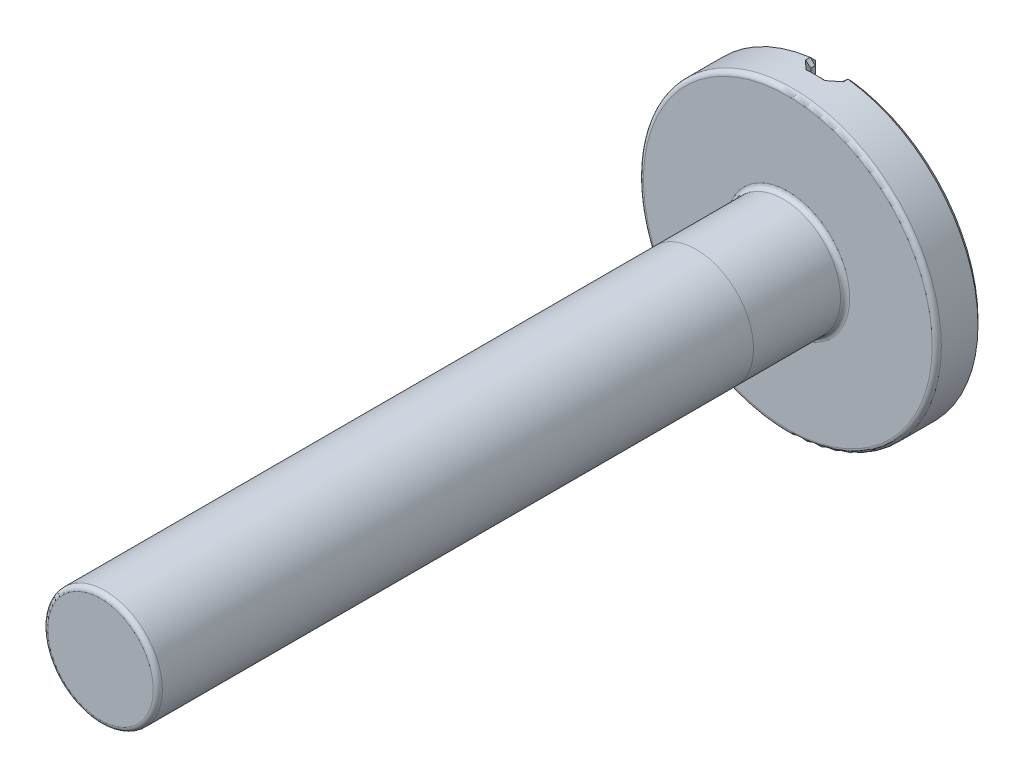
ISO-10303-21;
HEADER;
FILE_DESCRIPTION(('STEP AP214'),'2;1');
FILE_NAME('part.step','',(''),(''),'','','');
FILE_SCHEMA(('AUTOMOTIVE_DESIGN { 1 0 10303 214 1 1 1 1 }'));
ENDSEC;
DATA;
#1=APPLICATION_CONTEXT('core data for automotive mechanical design processes');
#2=APPLICATION_PROTOCOL_DEFINITION('international standard','automotive_design',2000,#1);
#3=PRODUCT_CONTEXT('',#1,'mechanical');
#4=PRODUCT('Part','Part','',(#3));
#5=PRODUCT_RELATED_PRODUCT_CATEGORY('part','',(#4));
#6=PRODUCT_DEFINITION_FORMATION('','',#4);
#7=PRODUCT_DEFINITION_CONTEXT('part definition',#1,'design');
#8=PRODUCT_DEFINITION('design','',#6,#7);
#9=PRODUCT_DEFINITION_SHAPE('','',#8);
#10=(LENGTH_UNIT() NAMED_UNIT(*) SI_UNIT(.MILLI.,.METRE.));
#11=(NAMED_UNIT(*) PLANE_ANGLE_UNIT() SI_UNIT($,.RADIAN.));
#12=(NAMED_UNIT(*) SI_UNIT($,.STERADIAN.) SOLID_ANGLE_UNIT());
#13=UNCERTAINTY_MEASURE_WITH_UNIT(LENGTH_MEASURE(1.E-05),#10,'distance_accuracy_value','');
#14=(GEOMETRIC_REPRESENTATION_CONTEXT(3) GLOBAL_UNCERTAINTY_ASSIGNED_CONTEXT((#13)) GLOBAL_UNIT_ASSIGNED_CONTEXT((#10,
#11,#12)) REPRESENTATION_CONTEXT('',''));
#15=CARTESIAN_POINT('',(0.,0.,0.));
#16=DIRECTION('',(0.,0.,1.));
#17=DIRECTION('',(1.,0.,0.));
#18=AXIS2_PLACEMENT_3D('',#15,#16,#17);
#19=CARTESIAN_POINT('',(0.,0.,7.5));
#20=DIRECTION('',(0.,0.,-1.));
#21=DIRECTION('',(-1.,0.,0.));
#22=AXIS2_PLACEMENT_3D('',#19,#20,#21);
#23=CYLINDRICAL_SURFACE('',#22,0.625);
#24=CARTESIAN_POINT('',(0.,0.,7.45));
#25=DIRECTION('',(0.,0.,1.));
#26=DIRECTION('',(1.,0.,0.));
#27=AXIS2_PLACEMENT_3D('',#24,#25,#26);
#28=CIRCLE('',#27,0.625);
#29=CARTESIAN_POINT('',(0.625,0.,7.45));
#30=VERTEX_POINT('',#29);
#31=EDGE_CURVE('E55',#30,#30,#28,.F.);
#32=ORIENTED_EDGE('',*,*,#31,.T.);
#33=EDGE_LOOP('',(#32));
#34=FACE_BOUND('',#33,.T.);
#35=CARTESIAN_POINT('',(0.,0.,0.999999999999999));
#36=DIRECTION('',(0.,0.,-1.));
#37=DIRECTION('',(0.,1.,0.));
#38=AXIS2_PLACEMENT_3D('',#35,#36,#37);
#39=CIRCLE('',#38,0.625);
#40=CARTESIAN_POINT('',(0.,0.625,0.999999999999999));
#41=VERTEX_POINT('',#40);
#42=EDGE_CURVE('E11',#41,#41,#39,.T.);
#43=ORIENTED_EDGE('',*,*,#42,.F.);
#44=EDGE_LOOP('',(#43));
#45=FACE_BOUND('',#44,.T.);
#46=ADVANCED_FACE('F46',(#34,#45),#23,.T.);
#47=CARTESIAN_POINT('',(0.,0.,-0.5));
#48=DIRECTION('',(0.,0.,1.));
#49=DIRECTION('',(1.,0.,0.));
#50=AXIS2_PLACEMENT_3D('',#47,#48,#49);
#51=CYLINDRICAL_SURFACE('',#50,1.625);
#52=CARTESIAN_POINT('',(0.,0.,-0.05));
#53=DIRECTION('',(0.,0.,1.));
#54=DIRECTION('',(1.,0.,0.));
#55=AXIS2_PLACEMENT_3D('',#52,#53,#54);
#56=CIRCLE('',#55,1.625);
#57=CARTESIAN_POINT('',(1.625,0.,-0.05));
#58=VERTEX_POINT('',#57);
#59=EDGE_CURVE('E514',#58,#58,#56,.F.);
#60=ORIENTED_EDGE('',*,*,#59,.T.);
#61=EDGE_LOOP('',(#60));
#62=FACE_BOUND('',#61,.T.);
#63=CARTESIAN_POINT('',(-0.206349206349206,1.61184521745702,-0.4));
#64=CARTESIAN_POINT('',(-0.197543907697521,1.61297235440929,-0.391183519980273));
#65=CARTESIAN_POINT('',(-0.188700261921241,1.61403127830941,-0.382396487362012));
#66=CARTESIAN_POINT('',(-0.170932435792585,1.61600963826394,-0.364888381673339));
#67=CARTESIAN_POINT('',(-0.162008255301008,1.6169290740772,-0.356167308716982));
#68=CARTESIAN_POINT('',(-0.136565822521117,1.61933576390132,-0.331524516627655));
#69=CARTESIAN_POINT('',(-0.119947344819389,1.62065362350429,-0.315689607558255));
#70=CARTESIAN_POINT('',(-0.103174603188669,1.62172130814234,-0.300000000008677));
#71=B_SPLINE_CURVE_WITH_KNOTS('',3,(#63,#64,#65,#66,#67,#68,#69,#70),.UNSPECIFIED.,.F.,.F.,(4,2,
2,4),(0.,0.0375339196909394,0.0750679042698759,0.144038304244722),.UNSPECIFIED.);
#72=CARTESIAN_POINT('',(-0.206349206349206,1.61184521745702,-0.4));
#73=VERTEX_POINT('',#72);
#74=CARTESIAN_POINT('',(-0.103174603174603,1.62172130813521,-0.3));
#75=VERTEX_POINT('',#74);
#76=EDGE_CURVE('E261',#73,#75,#71,.T.);
#77=ORIENTED_EDGE('',*,*,#76,.F.);
#78=DIRECTION('',(0.,0.,1.));
#79=VECTOR('',#78,1.);
#80=CARTESIAN_POINT('',(-0.206349206349206,1.61184521745702,-0.5));
#81=LINE('',#80,#79);
#82=CARTESIAN_POINT('',(-0.206349206349206,1.61184521745702,-0.450000000000001));
#83=VERTEX_POINT('',#82);
#84=EDGE_CURVE('E259',#73,#83,#81,.F.);
#85=ORIENTED_EDGE('',*,*,#84,.T.);
#86=CARTESIAN_POINT('',(0.,0.,-0.450000000000001));
#87=DIRECTION('',(0.,0.,1.));
#88=DIRECTION('',(1.,0.,0.));
#89=AXIS2_PLACEMENT_3D('',#86,#87,#88);
#90=CIRCLE('',#89,1.625);
#91=CARTESIAN_POINT('',(-0.206349206349206,-1.61184521745702,-0.450000000000001));
#92=VERTEX_POINT('',#91);
#93=EDGE_CURVE('E255',#83,#92,#90,.T.);
#94=ORIENTED_EDGE('',*,*,#93,.T.);
#95=DIRECTION('',(0.,0.,1.));
#96=VECTOR('',#95,1.);
#97=CARTESIAN_POINT('',(-0.206349206349206,-1.61184521745702,-0.5));
#98=LINE('',#97,#96);
#99=CARTESIAN_POINT('',(-0.206349206349206,-1.61184521745702,-0.4));
#100=VERTEX_POINT('',#99);
#101=EDGE_CURVE('E155',#92,#100,#98,.T.);
#102=ORIENTED_EDGE('',*,*,#101,.T.);
#103=CARTESIAN_POINT('',(-0.103174603174603,-1.62172130813521,-0.3));
#104=CARTESIAN_POINT('',(-0.112302280424125,-1.62114047216589,-0.3085375595702));
#105=CARTESIAN_POINT('',(-0.12138420138366,-1.62048540251161,-0.31711861021337));
#106=CARTESIAN_POINT('',(-0.139460502821526,-1.61902999956536,-0.334360209068561));
#107=CARTESIAN_POINT('',(-0.148454883522149,-1.61822966664236,-0.343020757078604));
#108=CARTESIAN_POINT('',(-0.17385828104927,-1.61575713723507,-0.36769762163173));
#109=CARTESIAN_POINT('',(-0.190168050894204,-1.61391613129194,-0.383799560876225));
#110=CARTESIAN_POINT('',(-0.206349206356989,-1.61184521746262,-0.400000000004097));
#111=B_SPLINE_CURVE_WITH_KNOTS('',3,(#103,#104,#105,#106,#107,#108,#109,#110),.UNSPECIFIED.,.F.,
.F.,(4,2,2,4),(0.,0.0375341707766793,0.0750682462175404,0.144038531963191),.UNSPECIFIED.);
#112=CARTESIAN_POINT('',(-0.103174603174603,-1.62172130813521,-0.3));
#113=VERTEX_POINT('',#112);
#114=EDGE_CURVE('E247',#113,#100,#111,.T.);
#115=ORIENTED_EDGE('',*,*,#114,.F.);
#116=CARTESIAN_POINT('',(0.,0.,-0.3));
#117=DIRECTION('',(0.,0.,-1.));
#118=DIRECTION('',(-1.,0.,0.));
#119=AXIS2_PLACEMENT_3D('',#116,#117,#118);
#120=CIRCLE('',#119,1.625);
#121=CARTESIAN_POINT('',(0.103174603174603,-1.62172130813521,-0.3));
#122=VERTEX_POINT('',#121);
#123=EDGE_CURVE('E203',#113,#122,#120,.F.);
#124=ORIENTED_EDGE('',*,*,#123,.T.);
#125=CARTESIAN_POINT('',(0.206349206349206,-1.61184521745702,-0.4));
#126=CARTESIAN_POINT('',(0.197543907697521,-1.61297235440929,-0.391183519980273));
#127=CARTESIAN_POINT('',(0.188700261921241,-1.61403127830941,-0.382396487362012));
#128=CARTESIAN_POINT('',(0.170932435792585,-1.61600963826394,-0.364888381673339));
#129=CARTESIAN_POINT('',(0.162008255301008,-1.6169290740772,-0.356167308716982));
#130=CARTESIAN_POINT('',(0.136565822521117,-1.61933576390132,-0.331524516627655));
#131=CARTESIAN_POINT('',(0.119947344819389,-1.62065362350429,-0.315689607558255));
#132=CARTESIAN_POINT('',(0.103174603188669,-1.62172130814234,-0.300000000008677));
#133=B_SPLINE_CURVE_WITH_KNOTS('',3,(#125,#126,#127,#128,#129,#130,#131,#132),.UNSPECIFIED.,.F.,
.F.,(4,2,2,4),(0.,0.0375339196909394,0.0750679042698759,0.144038304244722),.UNSPECIFIED.);
#134=CARTESIAN_POINT('',(0.206349206349206,-1.61184521745702,-0.4));
#135=VERTEX_POINT('',#134);
#136=EDGE_CURVE('E194',#135,#122,#133,.T.);
#137=ORIENTED_EDGE('',*,*,#136,.F.);
#138=DIRECTION('',(0.,0.,1.));
#139=VECTOR('',#138,1.);
#140=CARTESIAN_POINT('',(0.206349206349206,-1.61184521745702,-0.5));
#141=LINE('',#140,#139);
#142=CARTESIAN_POINT('',(0.206349206349206,-1.61184521745702,-0.450000000000001));
#143=VERTEX_POINT('',#142);
#144=EDGE_CURVE('E192',#135,#143,#141,.F.);
#145=ORIENTED_EDGE('',*,*,#144,.T.);
#146=CARTESIAN_POINT('',(0.,0.,-0.450000000000001));
#147=DIRECTION('',(0.,0.,1.));
#148=DIRECTION('',(1.,0.,0.));
#149=AXIS2_PLACEMENT_3D('',#146,#147,#148);
#150=CIRCLE('',#149,1.625);
#151=CARTESIAN_POINT('',(0.206349206349207,1.61184521745702,-0.450000000000001));
#152=VERTEX_POINT('',#151);
#153=EDGE_CURVE('E185',#143,#152,#150,.T.);
#154=ORIENTED_EDGE('',*,*,#153,.T.);
#155=DIRECTION('',(0.,0.,1.));
#156=VECTOR('',#155,1.);
#157=CARTESIAN_POINT('',(0.206349206349207,1.61184521745702,-0.5));
#158=LINE('',#157,#156);
#159=CARTESIAN_POINT('',(0.206349206349207,1.61184521745702,-0.4));
#160=VERTEX_POINT('',#159);
#161=EDGE_CURVE('E190',#152,#160,#158,.T.);
#162=ORIENTED_EDGE('',*,*,#161,.T.);
#163=CARTESIAN_POINT('',(0.103174603174603,1.62172130813521,-0.3));
#164=CARTESIAN_POINT('',(0.112302280424125,1.62114047216589,-0.3085375595702));
#165=CARTESIAN_POINT('',(0.12138420138366,1.62048540251161,-0.31711861021337));
#166=CARTESIAN_POINT('',(0.139460502821526,1.61902999956536,-0.334360209068561));
#167=CARTESIAN_POINT('',(0.148454883522149,1.61822966664235,-0.343020757078605));
#168=CARTESIAN_POINT('',(0.173858281049271,1.61575713723507,-0.36769762163173));
#169=CARTESIAN_POINT('',(0.190168050894205,1.61391613129194,-0.383799560876225));
#170=CARTESIAN_POINT('',(0.206349206356989,1.61184521746262,-0.400000000004097));
#171=B_SPLINE_CURVE_WITH_KNOTS('',3,(#163,#164,#165,#166,#167,#168,#169,#170),.UNSPECIFIED.,.F.,
.F.,(4,2,2,4),(0.,0.0375341707766796,0.0750682462175409,0.144038531963192),.UNSPECIFIED.);
#172=CARTESIAN_POINT('',(0.103174603174603,1.62172130813521,-0.3));
#173=VERTEX_POINT('',#172);
#174=EDGE_CURVE('E240',#173,#160,#171,.T.);
#175=ORIENTED_EDGE('',*,*,#174,.F.);
#176=CARTESIAN_POINT('',(0.,0.,-0.3));
#177=DIRECTION('',(0.,0.,-1.));
#178=DIRECTION('',(-1.,0.,0.));
#179=AXIS2_PLACEMENT_3D('',#176,#177,#178);
#180=CIRCLE('',#179,1.625);
#181=EDGE_CURVE('E257',#173,#75,#180,.F.);
#182=ORIENTED_EDGE('',*,*,#181,.T.);
#183=EDGE_LOOP('',(#77,#85,#94,#102,#115,#124,#137,#145,#154,#162,#175,#182));
#184=FACE_BOUND('',#183,.T.);
#185=ADVANCED_FACE('F205',(#62,#184),#51,.T.);
#186=CARTESIAN_POINT('',(0.,0.,-0.5));
#187=DIRECTION('',(0.,0.,1.));
#188=DIRECTION('',(1.,0.,0.));
#189=AXIS2_PLACEMENT_3D('',#186,#187,#188);
#190=PLANE('',#189);
#191=CARTESIAN_POINT('',(0.,0.,-0.5));
#192=DIRECTION('',(0.,0.,1.));
#193=DIRECTION('',(1.,0.,0.));
#194=AXIS2_PLACEMENT_3D('',#191,#192,#193);
#195=CIRCLE('',#194,1.575);
#196=CARTESIAN_POINT('',(0.2,1.5622499799968,-0.5));
#197=VERTEX_POINT('',#196);
#198=CARTESIAN_POINT('',(0.2,-1.5622499799968,-0.5));
#199=VERTEX_POINT('',#198);
#200=EDGE_CURVE('E61',#197,#199,#195,.F.);
#201=ORIENTED_EDGE('',*,*,#200,.T.);
#202=DIRECTION('',(0.,1.,0.));
#203=VECTOR('',#202,1.);
#204=CARTESIAN_POINT('',(0.2,0.,-0.5));
#205=LINE('',#204,#203);
#206=EDGE_CURVE('E530',#199,#197,#205,.T.);
#207=ORIENTED_EDGE('',*,*,#206,.T.);
#208=EDGE_LOOP('',(#201,#207));
#209=FACE_BOUND('',#208,.T.);
#210=ADVANCED_FACE('F494',(#209),#190,.F.);
#211=ORIENTED_EDGE('',*,*,#42,.T.);
#212=EDGE_LOOP('',(#211));
#213=FACE_BOUND('',#212,.T.);
#214=CARTESIAN_POINT('',(0.,0.,0.0499999999999997));
#215=DIRECTION('',(0.,0.,1.));
#216=DIRECTION('',(1.,0.,0.));
#217=AXIS2_PLACEMENT_3D('',#214,#215,#216);
#218=CIRCLE('',#217,0.625);
#219=CARTESIAN_POINT('',(0.625,0.,0.0499999999999997));
#220=VERTEX_POINT('',#219);
#221=EDGE_CURVE('E512',#220,#220,#218,.T.);
#222=ORIENTED_EDGE('',*,*,#221,.T.);
#223=EDGE_LOOP('',(#222));
#224=FACE_BOUND('',#223,.T.);
#225=ADVANCED_FACE('F218',(#213,#224),#23,.T.);
#226=CARTESIAN_POINT('',(0.,0.,7.5));
#227=DIRECTION('',(0.,0.,1.));
#228=DIRECTION('',(1.,0.,0.));
#229=AXIS2_PLACEMENT_3D('',#226,#227,#228);
#230=PLANE('',#229);
#231=CARTESIAN_POINT('',(0.,0.,7.5));
#232=DIRECTION('',(0.,0.,1.));
#233=DIRECTION('',(1.,0.,0.));
#234=AXIS2_PLACEMENT_3D('',#231,#232,#233);
#235=CIRCLE('',#234,0.575);
#236=CARTESIAN_POINT('',(0.575,0.,7.5));
#237=VERTEX_POINT('',#236);
#238=EDGE_CURVE('E513',#237,#237,#235,.T.);
#239=ORIENTED_EDGE('',*,*,#238,.T.);
#240=EDGE_LOOP('',(#239));
#241=FACE_BOUND('',#240,.T.);
#242=ADVANCED_FACE('F499',(#241),#230,.T.);
#243=CARTESIAN_POINT('',(0.,0.,-0.5));
#244=DIRECTION('',(0.,0.,1.));
#245=DIRECTION('',(1.,0.,0.));
#246=AXIS2_PLACEMENT_3D('',#243,#244,#245);
#247=CIRCLE('',#246,1.575);
#248=CARTESIAN_POINT('',(-0.2,-1.5622499799968,-0.5));
#249=VERTEX_POINT('',#248);
#250=CARTESIAN_POINT('',(-0.2,1.5622499799968,-0.5));
#251=VERTEX_POINT('',#250);
#252=EDGE_CURVE('E593',#249,#251,#247,.F.);
#253=ORIENTED_EDGE('',*,*,#252,.T.);
#254=DIRECTION('',(0.,-1.,0.));
#255=VECTOR('',#254,1.);
#256=CARTESIAN_POINT('',(-0.2,0.,-0.5));
#257=LINE('',#256,#255);
#258=EDGE_CURVE('E600',#251,#249,#257,.T.);
#259=ORIENTED_EDGE('',*,*,#258,.T.);
#260=EDGE_LOOP('',(#253,#259));
#261=FACE_BOUND('',#260,.T.);
#262=ADVANCED_FACE('F505',(#261),#190,.F.);
#263=CARTESIAN_POINT('',(0.,0.,0.));
#264=DIRECTION('',(0.,0.,1.));
#265=DIRECTION('',(1.,0.,0.));
#266=AXIS2_PLACEMENT_3D('',#263,#264,#265);
#267=PLANE('',#266);
#268=CARTESIAN_POINT('',(0.,0.,0.));
#269=DIRECTION('',(0.,0.,1.));
#270=DIRECTION('',(1.,0.,0.));
#271=AXIS2_PLACEMENT_3D('',#268,#269,#270);
#272=CIRCLE('',#271,1.575);
#273=CARTESIAN_POINT('',(1.575,0.,0.));
#274=VERTEX_POINT('',#273);
#275=EDGE_CURVE('E519',#274,#274,#272,.T.);
#276=ORIENTED_EDGE('',*,*,#275,.T.);
#277=EDGE_LOOP('',(#276));
#278=FACE_BOUND('',#277,.T.);
#279=CARTESIAN_POINT('',(0.,0.,0.));
#280=DIRECTION('',(0.,0.,1.));
#281=DIRECTION('',(1.,0.,0.));
#282=AXIS2_PLACEMENT_3D('',#279,#280,#281);
#283=CIRCLE('',#282,0.675);
#284=CARTESIAN_POINT('',(0.675,0.,0.));
#285=VERTEX_POINT('',#284);
#286=EDGE_CURVE('E527',#285,#285,#283,.F.);
#287=ORIENTED_EDGE('',*,*,#286,.T.);
#288=EDGE_LOOP('',(#287));
#289=FACE_BOUND('',#288,.T.);
#290=ADVANCED_FACE('F617',(#278,#289),#267,.T.);
#291=CARTESIAN_POINT('',(0.15,-3.72872824867462,-0.35));
#292=DIRECTION('',(1.,0.,0.));
#293=DIRECTION('',(0.,0.,-1.));
#294=AXIS2_PLACEMENT_3D('',#291,#292,#293);
#295=PLANE('',#294);
#296=DIRECTION('',(0.,0.,1.));
#297=VECTOR('',#296,1.);
#298=CARTESIAN_POINT('',(0.15,-1.5622499799968,-0.35));
#299=LINE('',#298,#297);
#300=CARTESIAN_POINT('',(0.15,-1.5622499799968,-0.450000000000001));
#301=VERTEX_POINT('',#300);
#302=CARTESIAN_POINT('',(0.15,-1.5622499799968,-0.4));
#303=VERTEX_POINT('',#302);
#304=EDGE_CURVE('E554',#301,#303,#299,.T.);
#305=ORIENTED_EDGE('',*,*,#304,.T.);
#306=DIRECTION('',(0.,1.,0.));
#307=VECTOR('',#306,1.);
#308=CARTESIAN_POINT('',(0.15,-3.72872824867462,-0.4));
#309=LINE('',#308,#307);
#310=CARTESIAN_POINT('',(0.15,1.5622499799968,-0.4));
#311=VERTEX_POINT('',#310);
#312=EDGE_CURVE('E955',#303,#311,#309,.T.);
#313=ORIENTED_EDGE('',*,*,#312,.T.);
#314=DIRECTION('',(0.,0.,-1.));
#315=VECTOR('',#314,1.);
#316=CARTESIAN_POINT('',(0.15,1.5622499799968,-0.5));
#317=LINE('',#316,#315);
#318=CARTESIAN_POINT('',(0.15,1.5622499799968,-0.450000000000001));
#319=VERTEX_POINT('',#318);
#320=EDGE_CURVE('E958',#311,#319,#317,.T.);
#321=ORIENTED_EDGE('',*,*,#320,.T.);
#322=DIRECTION('',(0.,-1.,0.));
#323=VECTOR('',#322,1.);
#324=CARTESIAN_POINT('',(0.15,-3.72872824867462,-0.450000000000001));
#325=LINE('',#324,#323);
#326=EDGE_CURVE('E268',#319,#301,#325,.T.);
#327=ORIENTED_EDGE('',*,*,#326,.T.);
#328=EDGE_LOOP('',(#305,#313,#321,#327));
#329=FACE_BOUND('',#328,.T.);
#330=ADVANCED_FACE('F621',(#329),#295,.F.);
#331=CARTESIAN_POINT('',(-0.15,-3.72872824867462,-0.35));
#332=DIRECTION('',(-1.,0.,0.));
#333=DIRECTION('',(0.,0.,1.));
#334=AXIS2_PLACEMENT_3D('',#331,#332,#333);
#335=PLANE('',#334);
#336=DIRECTION('',(0.,0.,1.));
#337=VECTOR('',#336,1.);
#338=CARTESIAN_POINT('',(-0.15,1.5622499799968,-0.35));
#339=LINE('',#338,#337);
#340=CARTESIAN_POINT('',(-0.15,1.5622499799968,-0.450000000000001));
#341=VERTEX_POINT('',#340);
#342=CARTESIAN_POINT('',(-0.15,1.5622499799968,-0.4));
#343=VERTEX_POINT('',#342);
#344=EDGE_CURVE('E177',#341,#343,#339,.T.);
#345=ORIENTED_EDGE('',*,*,#344,.T.);
#346=DIRECTION('',(0.,-1.,0.));
#347=VECTOR('',#346,1.);
#348=CARTESIAN_POINT('',(-0.15,-3.72872824867462,-0.4));
#349=LINE('',#348,#347);
#350=CARTESIAN_POINT('',(-0.15,-1.5622499799968,-0.4));
#351=VERTEX_POINT('',#350);
#352=EDGE_CURVE('E182',#343,#351,#349,.T.);
#353=ORIENTED_EDGE('',*,*,#352,.T.);
#354=DIRECTION('',(0.,0.,-1.));
#355=VECTOR('',#354,1.);
#356=CARTESIAN_POINT('',(-0.15,-1.5622499799968,-0.5));
#357=LINE('',#356,#355);
#358=CARTESIAN_POINT('',(-0.15,-1.5622499799968,-0.450000000000001));
#359=VERTEX_POINT('',#358);
#360=EDGE_CURVE('E153',#351,#359,#357,.T.);
#361=ORIENTED_EDGE('',*,*,#360,.T.);
#362=DIRECTION('',(0.,1.,0.));
#363=VECTOR('',#362,1.);
#364=CARTESIAN_POINT('',(-0.15,-3.72872824867462,-0.450000000000001));
#365=LINE('',#364,#363);
#366=EDGE_CURVE('E171',#359,#341,#365,.T.);
#367=ORIENTED_EDGE('',*,*,#366,.T.);
#368=EDGE_LOOP('',(#345,#353,#361,#367));
#369=FACE_BOUND('',#368,.T.);
#370=ADVANCED_FACE('F180',(#369),#335,.F.);
#371=CARTESIAN_POINT('',(0.,0.,-0.35));
#372=DIRECTION('',(0.,0.,-1.));
#373=DIRECTION('',(-1.,0.,0.));
#374=AXIS2_PLACEMENT_3D('',#371,#372,#373);
#375=PLANE('',#374);
#376=DIRECTION('',(0.,-1.,0.));
#377=VECTOR('',#376,1.);
#378=CARTESIAN_POINT('',(0.0999999999999994,0.,-0.35));
#379=LINE('',#378,#377);
#380=CARTESIAN_POINT('',(0.0999999999999994,1.57182219096181,-0.35));
#381=VERTEX_POINT('',#380);
#382=CARTESIAN_POINT('',(0.0999999999999994,-1.57182219096181,-0.35));
#383=VERTEX_POINT('',#382);
#384=EDGE_CURVE('E590',#381,#383,#379,.T.);
#385=ORIENTED_EDGE('',*,*,#384,.T.);
#386=CARTESIAN_POINT('',(0.,0.,-0.35));
#387=DIRECTION('',(0.,0.,-1.));
#388=DIRECTION('',(-1.,0.,0.));
#389=AXIS2_PLACEMENT_3D('',#386,#387,#388);
#390=CIRCLE('',#389,1.575);
#391=CARTESIAN_POINT('',(-0.0999999999999994,-1.57182219096181,-0.35));
#392=VERTEX_POINT('',#391);
#393=EDGE_CURVE('E569',#383,#392,#390,.T.);
#394=ORIENTED_EDGE('',*,*,#393,.T.);
#395=DIRECTION('',(0.,1.,0.));
#396=VECTOR('',#395,1.);
#397=CARTESIAN_POINT('',(-0.0999999999999994,0.,-0.35));
#398=LINE('',#397,#396);
#399=CARTESIAN_POINT('',(-0.0999999999999994,1.57182219096181,-0.35));
#400=VERTEX_POINT('',#399);
#401=EDGE_CURVE('E595',#392,#400,#398,.T.);
#402=ORIENTED_EDGE('',*,*,#401,.T.);
#403=CARTESIAN_POINT('',(0.,0.,-0.35));
#404=DIRECTION('',(0.,0.,-1.));
#405=DIRECTION('',(-1.,0.,0.));
#406=AXIS2_PLACEMENT_3D('',#403,#404,#405);
#407=CIRCLE('',#406,1.575);
#408=EDGE_CURVE('E587',#400,#381,#407,.T.);
#409=ORIENTED_EDGE('',*,*,#408,.T.);
#410=EDGE_LOOP('',(#385,#394,#402,#409));
#411=FACE_BOUND('',#410,.T.);
#412=ADVANCED_FACE('F476',(#411),#375,.T.);
#413=CARTESIAN_POINT('',(0.15,1.5622499799968,-0.450000000000001));
#414=DIRECTION('',(-0.551241692286524,0.626310780180389,-0.551241692286534));
#415=DIRECTION('',(0.,0.660687472643412,0.750661084306401));
#416=AXIS2_PLACEMENT_3D('',#413,#414,#415);
#417=PLANE('',#416);
#418=DIRECTION('',(0.750661084306406,0.660687472643405,0.));
#419=VECTOR('',#418,1.);
#420=CARTESIAN_POINT('',(0.15,1.5622499799968,-0.450000000000001));
#421=LINE('',#420,#419);
#422=EDGE_CURVE('E535',#152,#319,#421,.F.);
#423=ORIENTED_EDGE('',*,*,#422,.F.);
#424=DIRECTION('',(-0.0897913372935395,-0.701382574453519,-0.707106781186541));
#425=VECTOR('',#424,1.);
#426=CARTESIAN_POINT('',(0.,0.,-2.07499999999998));
#427=LINE('',#426,#425);
#428=EDGE_CURVE('E178',#197,#152,#427,.F.);
#429=ORIENTED_EDGE('',*,*,#428,.F.);
#430=DIRECTION('',(0.707106781186554,0.,-0.707106781186541));
#431=VECTOR('',#430,1.);
#432=CARTESIAN_POINT('',(0.15,1.5622499799968,-0.450000000000001));
#433=LINE('',#432,#431);
#434=EDGE_CURVE('E532',#319,#197,#433,.T.);
#435=ORIENTED_EDGE('',*,*,#434,.F.);
#436=EDGE_LOOP('',(#423,#429,#435));
#437=FACE_BOUND('',#436,.T.);
#438=ADVANCED_FACE('F471',(#437),#417,.T.);
#439=CARTESIAN_POINT('',(0.,0.,-0.450000000000001));
#440=DIRECTION('',(0.,0.,1.));
#441=DIRECTION('',(1.,0.,0.));
#442=AXIS2_PLACEMENT_3D('',#439,#440,#441);
#443=CONICAL_SURFACE('',#442,1.625,0.785398163397457);
#444=ORIENTED_EDGE('',*,*,#428,.T.);
#445=ORIENTED_EDGE('',*,*,#153,.F.);
#446=DIRECTION('',(0.0897913372935243,-0.701382574453521,0.707106781186541));
#447=VECTOR('',#446,1.);
#448=CARTESIAN_POINT('',(0.,0.,-2.07499999999997));
#449=LINE('',#448,#447);
#450=EDGE_CURVE('E538',#199,#143,#449,.T.);
#451=ORIENTED_EDGE('',*,*,#450,.F.);
#452=ORIENTED_EDGE('',*,*,#200,.F.);
#453=EDGE_LOOP('',(#444,#445,#451,#452));
#454=FACE_BOUND('',#453,.T.);
#455=ADVANCED_FACE('F465',(#454),#443,.T.);
#456=CARTESIAN_POINT('',(0.2,0.,-0.5));
#457=DIRECTION('',(0.707106781186541,0.,0.707106781186554));
#458=DIRECTION('',(0.,1.,0.));
#459=AXIS2_PLACEMENT_3D('',#456,#457,#458);
#460=PLANE('',#459);
#461=ORIENTED_EDGE('',*,*,#434,.T.);
#462=ORIENTED_EDGE('',*,*,#206,.F.);
#463=DIRECTION('',(-0.707106781186554,0.,0.707106781186541));
#464=VECTOR('',#463,1.);
#465=CARTESIAN_POINT('',(0.178174603174604,-1.5622499799968,-0.478174603174604));
#466=LINE('',#465,#464);
#467=EDGE_CURVE('E541',#301,#199,#466,.F.);
#468=ORIENTED_EDGE('',*,*,#467,.F.);
#469=ORIENTED_EDGE('',*,*,#326,.F.);
#470=EDGE_LOOP('',(#461,#462,#468,#469));
#471=FACE_BOUND('',#470,.T.);
#472=ADVANCED_FACE('F458',(#471),#460,.F.);
#473=CARTESIAN_POINT('',(0.15,1.5622499799968,-0.5));
#474=DIRECTION('',(-0.660687472643405,0.750661084306406,0.));
#475=DIRECTION('',(0.,0.,1.));
#476=AXIS2_PLACEMENT_3D('',#473,#474,#475);
#477=PLANE('',#476);
#478=ORIENTED_EDGE('',*,*,#422,.T.);
#479=ORIENTED_EDGE('',*,*,#320,.F.);
#480=DIRECTION('',(-0.750661084306406,-0.660687472643405,0.));
#481=VECTOR('',#480,1.);
#482=CARTESIAN_POINT('',(0.206349206349207,1.61184521745702,-0.4));
#483=LINE('',#482,#481);
#484=EDGE_CURVE('E543',#160,#311,#483,.T.);
#485=ORIENTED_EDGE('',*,*,#484,.F.);
#486=ORIENTED_EDGE('',*,*,#161,.F.);
#487=EDGE_LOOP('',(#478,#479,#485,#486));
#488=FACE_BOUND('',#487,.T.);
#489=ADVANCED_FACE('F451',(#488),#477,.T.);
#490=CARTESIAN_POINT('',(0.206349206349206,-1.61184521745702,-0.450000000000001));
#491=DIRECTION('',(-0.551241692286532,-0.626310780180379,-0.551241692286537));
#492=DIRECTION('',(0.,0.660687472643419,-0.750661084306394));
#493=AXIS2_PLACEMENT_3D('',#490,#491,#492);
#494=PLANE('',#493);
#495=ORIENTED_EDGE('',*,*,#467,.T.);
#496=ORIENTED_EDGE('',*,*,#450,.T.);
#497=DIRECTION('',(0.750661084306398,-0.660687472643415,0.));
#498=VECTOR('',#497,1.);
#499=CARTESIAN_POINT('',(0.206349206349206,-1.61184521745702,-0.450000000000001));
#500=LINE('',#499,#498);
#501=EDGE_CURVE('E406',#301,#143,#500,.T.);
#502=ORIENTED_EDGE('',*,*,#501,.F.);
#503=EDGE_LOOP('',(#495,#496,#502));
#504=FACE_BOUND('',#503,.T.);
#505=ADVANCED_FACE('F439',(#504),#494,.T.);
#506=CARTESIAN_POINT('',(0.0999999999999994,1.57182219096181,-0.35));
#507=CARTESIAN_POINT('',(0.15,1.5622499799968,-0.4));
#508=CARTESIAN_POINT('',(0.103174603174603,1.62172130813521,-0.3));
#509=CARTESIAN_POINT('',(0.206349206349207,1.61184521745702,-0.4));
#510=CARTESIAN_POINT('',(0.103245110719675,1.62282956137496,-0.29888950616511));
#511=CARTESIAN_POINT('',(0.207600715274242,1.61294672156581,-0.4));
#512=B_SPLINE_SURFACE_WITH_KNOTS('',1,1,((#506,#507),(#508,#509),(#510,#511)),.UNSPECIFIED.,.F.,
.F.,.F.,(2,1,2),(2,2),(0.,1.,1.02220987669781),(0.,1.),.UNSPECIFIED.);
#513=CARTESIAN_POINT('',(0.15,1.5622499799968,-0.4));
#514=CARTESIAN_POINT('',(0.145616668058701,1.56308914355824,-0.395616668058701));
#515=CARTESIAN_POINT('',(0.141233336117403,1.56392830711967,-0.391233336117402));
#516=CARTESIAN_POINT('',(0.132466672234805,1.56560663424254,-0.382466672234805));
#517=CARTESIAN_POINT('',(0.128083340293506,1.56644579780398,-0.378083340293507));
#518=CARTESIAN_POINT('',(0.115800005568138,1.56879737123088,-0.365800005568139));
#519=CARTESIAN_POINT('',(0.107900002784069,1.57030978109635,-0.357900002784069));
#520=CARTESIAN_POINT('',(0.0999999999999994,1.57182219096181,-0.35));
#521=B_SPLINE_CURVE_WITH_KNOTS('',3,(#513,#514,#515,#516,#517,#518,#519,#520),.UNSPECIFIED.,.F.,
.F.,(4,2,2,4),(0.,0.0187665271076601,0.0375330542153203,0.0713556390396637),.UNSPECIFIED.);
#522=EDGE_CURVE('E397',#381,#311,#521,.F.);
#523=DIRECTION('',(0.0448956686467649,0.705680082570542,0.707106781186542));
#524=VECTOR('',#523,1.);
#525=CARTESIAN_POINT('',(0.0999999999999994,1.57182219096181,-0.35));
#526=LINE('',#525,#524);
#527=EDGE_CURVE('E407',#173,#381,#526,.F.);
#528=ORIENTED_EDGE('',*,*,#174,.T.);
#529=ORIENTED_EDGE('',*,*,#484,.T.);
#530=ORIENTED_EDGE('',*,*,#522,.F.);
#531=ORIENTED_EDGE('',*,*,#527,.F.);
#532=EDGE_LOOP('',(#528,#529,#530,#531));
#533=FACE_BOUND('',#532,.T.);
#534=ADVANCED_FACE('F430',(#533),#512,.T.);
#535=CARTESIAN_POINT('',(0.15,-1.5622499799968,-0.5));
#536=DIRECTION('',(0.660687472643415,0.750661084306398,0.));
#537=DIRECTION('',(0.,0.,1.));
#538=AXIS2_PLACEMENT_3D('',#535,#536,#537);
#539=PLANE('',#538);
#540=ORIENTED_EDGE('',*,*,#501,.T.);
#541=ORIENTED_EDGE('',*,*,#144,.F.);
#542=DIRECTION('',(0.750661084306398,-0.660687472643415,0.));
#543=VECTOR('',#542,1.);
#544=CARTESIAN_POINT('',(0.15,-1.5622499799968,-0.4));
#545=LINE('',#544,#543);
#546=EDGE_CURVE('E565',#303,#135,#545,.T.);
#547=ORIENTED_EDGE('',*,*,#546,.F.);
#548=ORIENTED_EDGE('',*,*,#304,.F.);
#549=EDGE_LOOP('',(#540,#541,#547,#548));
#550=FACE_BOUND('',#549,.T.);
#551=ADVANCED_FACE('F381',(#550),#539,.F.);
#552=CARTESIAN_POINT('',(0.0999999999999994,0.,-0.35));
#553=DIRECTION('',(0.707106781186541,0.,0.707106781186554));
#554=DIRECTION('',(0.,-1.,0.));
#555=AXIS2_PLACEMENT_3D('',#552,#553,#554);
#556=PLANE('',#555);
#557=ORIENTED_EDGE('',*,*,#522,.T.);
#558=ORIENTED_EDGE('',*,*,#312,.F.);
#559=CARTESIAN_POINT('',(0.0999999999999994,-1.57182219096181,-0.35));
#560=CARTESIAN_POINT('',(0.104383331941298,-1.57098302740038,-0.354383331941299));
#561=CARTESIAN_POINT('',(0.108766663882597,-1.57014386383894,-0.358766663882597));
#562=CARTESIAN_POINT('',(0.117533327765194,-1.56846553671607,-0.367533327765194));
#563=CARTESIAN_POINT('',(0.121916659706493,-1.56762637315463,-0.371916659706493));
#564=CARTESIAN_POINT('',(0.134199994431861,-1.56527479972773,-0.384199994431861));
#565=CARTESIAN_POINT('',(0.14209999721593,-1.56376238986227,-0.39209999721593));
#566=CARTESIAN_POINT('',(0.15,-1.5622499799968,-0.4));
#567=B_SPLINE_CURVE_WITH_KNOTS('',3,(#559,#560,#561,#562,#563,#564,#565,#566),.UNSPECIFIED.,.F.,
.F.,(4,2,2,4),(0.,0.01876652710766,0.03753305421532,0.0713556390396638),.UNSPECIFIED.);
#568=EDGE_CURVE('E389',#383,#303,#567,.T.);
#569=ORIENTED_EDGE('',*,*,#568,.F.);
#570=ORIENTED_EDGE('',*,*,#384,.F.);
#571=EDGE_LOOP('',(#557,#558,#569,#570));
#572=FACE_BOUND('',#571,.T.);
#573=ADVANCED_FACE('F368',(#572),#556,.F.);
#574=CARTESIAN_POINT('',(0.,0.,-0.3));
#575=DIRECTION('',(0.,0.,1.));
#576=DIRECTION('',(1.,0.,0.));
#577=AXIS2_PLACEMENT_3D('',#574,#575,#576);
#578=CONICAL_SURFACE('',#577,1.625,0.785398163397457);
#579=ORIENTED_EDGE('',*,*,#527,.T.);
#580=ORIENTED_EDGE('',*,*,#408,.F.);
#581=DIRECTION('',(0.0448956686467649,-0.705680082570542,-0.707106781186542));
#582=VECTOR('',#581,1.);
#583=CARTESIAN_POINT('',(-0.103174603174603,1.62172130813521,-0.3));
#584=LINE('',#583,#582);
#585=EDGE_CURVE('E576',#75,#400,#584,.T.);
#586=ORIENTED_EDGE('',*,*,#585,.F.);
#587=ORIENTED_EDGE('',*,*,#181,.F.);
#588=EDGE_LOOP('',(#579,#580,#586,#587));
#589=FACE_BOUND('',#588,.T.);
#590=ADVANCED_FACE('F380',(#589),#578,.T.);
#591=CARTESIAN_POINT('',(-0.15,1.5622499799968,-0.5));
#592=DIRECTION('',(-0.660687472643415,-0.750661084306398,0.));
#593=DIRECTION('',(0.,0.,1.));
#594=AXIS2_PLACEMENT_3D('',#591,#592,#593);
#595=PLANE('',#594);
#596=DIRECTION('',(-0.750661084306398,0.660687472643415,0.));
#597=VECTOR('',#596,1.);
#598=CARTESIAN_POINT('',(-0.206349206349206,1.61184521745702,-0.450000000000001));
#599=LINE('',#598,#597);
#600=EDGE_CURVE('E570',#83,#341,#599,.F.);
#601=ORIENTED_EDGE('',*,*,#600,.F.);
#602=ORIENTED_EDGE('',*,*,#84,.F.);
#603=DIRECTION('',(-0.750661084306398,0.660687472643415,0.));
#604=VECTOR('',#603,1.);
#605=CARTESIAN_POINT('',(-0.15,1.5622499799968,-0.4));
#606=LINE('',#605,#604);
#607=EDGE_CURVE('E572',#343,#73,#606,.T.);
#608=ORIENTED_EDGE('',*,*,#607,.F.);
#609=ORIENTED_EDGE('',*,*,#344,.F.);
#610=EDGE_LOOP('',(#601,#602,#608,#609));
#611=FACE_BOUND('',#610,.T.);
#612=ADVANCED_FACE('F672',(#611),#595,.F.);
#613=CARTESIAN_POINT('',(0.15,-1.5622499799968,-0.4));
#614=CARTESIAN_POINT('',(0.0999999999999994,-1.57182219096181,-0.35));
#615=CARTESIAN_POINT('',(0.206349206349206,-1.61184521745702,-0.4));
#616=CARTESIAN_POINT('',(0.103174603174603,-1.62172130813521,-0.3));
#617=CARTESIAN_POINT('',(0.207586682651519,-1.61293437088154,-0.4));
#618=CARTESIAN_POINT('',(0.103244320149381,-1.62281713501564,-0.298901957647244));
#619=B_SPLINE_SURFACE_WITH_KNOTS('',1,1,((#613,#614),(#615,#616),(#617,#618)),.UNSPECIFIED.,.F.,
.F.,.F.,(2,1,2),(2,2),(0.,1.,1.02196084705514),(0.,1.),.UNSPECIFIED.);
#620=DIRECTION('',(-0.0448956686467649,0.705680082570542,-0.707106781186542));
#621=VECTOR('',#620,1.);
#622=CARTESIAN_POINT('',(0.103174603174603,-1.62172130813521,-0.3));
#623=LINE('',#622,#621);
#624=EDGE_CURVE('E326',#383,#122,#623,.F.);
#625=ORIENTED_EDGE('',*,*,#546,.T.);
#626=ORIENTED_EDGE('',*,*,#136,.T.);
#627=ORIENTED_EDGE('',*,*,#624,.F.);
#628=ORIENTED_EDGE('',*,*,#568,.T.);
#629=EDGE_LOOP('',(#625,#626,#627,#628));
#630=FACE_BOUND('',#629,.T.);
#631=ADVANCED_FACE('F366',(#630),#619,.T.);
#632=CARTESIAN_POINT('',(-0.15,1.5622499799968,-0.4));
#633=CARTESIAN_POINT('',(-0.0999999999999994,1.57182219096181,-0.35));
#634=CARTESIAN_POINT('',(-0.206349206349206,1.61184521745702,-0.4));
#635=CARTESIAN_POINT('',(-0.103174603174603,1.62172130813521,-0.3));
#636=CARTESIAN_POINT('',(-0.207586682651519,1.61293437088154,-0.4));
#637=CARTESIAN_POINT('',(-0.103244320149381,1.62281713501564,-0.298901957647244));
#638=B_SPLINE_SURFACE_WITH_KNOTS('',1,1,((#632,#633),(#634,#635),(#636,#637)),.UNSPECIFIED.,.F.,
.F.,.F.,(2,1,2),(2,2),(0.,1.,1.02196084705514),(0.,1.),.UNSPECIFIED.);
#639=CARTESIAN_POINT('',(-0.0999999999999994,1.57182219096181,-0.35));
#640=CARTESIAN_POINT('',(-0.104383331941298,1.57098302740038,-0.354383331941299));
#641=CARTESIAN_POINT('',(-0.108766663882597,1.57014386383894,-0.358766663882597));
#642=CARTESIAN_POINT('',(-0.117533327765194,1.56846553671607,-0.367533327765194));
#643=CARTESIAN_POINT('',(-0.121916659706493,1.56762637315463,-0.371916659706493));
#644=CARTESIAN_POINT('',(-0.134199994431861,1.56527479972773,-0.384199994431861));
#645=CARTESIAN_POINT('',(-0.14209999721593,1.56376238986227,-0.39209999721593));
#646=CARTESIAN_POINT('',(-0.15,1.5622499799968,-0.4));
#647=B_SPLINE_CURVE_WITH_KNOTS('',3,(#639,#640,#641,#642,#643,#644,#645,#646),.UNSPECIFIED.,.F.,
.F.,(4,2,2,4),(0.,0.01876652710766,0.03753305421532,0.0713556390396638),.UNSPECIFIED.);
#648=EDGE_CURVE('E317',#343,#400,#647,.F.);
#649=ORIENTED_EDGE('',*,*,#76,.T.);
#650=ORIENTED_EDGE('',*,*,#585,.T.);
#651=ORIENTED_EDGE('',*,*,#648,.F.);
#652=ORIENTED_EDGE('',*,*,#607,.T.);
#653=EDGE_LOOP('',(#649,#650,#651,#652));
#654=FACE_BOUND('',#653,.T.);
#655=ADVANCED_FACE('F357',(#654),#638,.T.);
#656=CARTESIAN_POINT('',(-0.206349206349206,1.61184521745702,-0.450000000000001));
#657=DIRECTION('',(0.551241692286532,0.626310780180379,-0.551241692286537));
#658=DIRECTION('',(0.,0.660687472643419,0.750661084306394));
#659=AXIS2_PLACEMENT_3D('',#656,#657,#658);
#660=PLANE('',#659);
#661=DIRECTION('',(-0.0897913372935243,0.701382574453521,0.707106781186541));
#662=VECTOR('',#661,1.);
#663=CARTESIAN_POINT('',(0.,0.,-2.07499999999997));
#664=LINE('',#663,#662);
#665=EDGE_CURVE('E614',#83,#251,#664,.F.);
#666=ORIENTED_EDGE('',*,*,#665,.F.);
#667=ORIENTED_EDGE('',*,*,#600,.T.);
#668=DIRECTION('',(0.707106781186554,0.,0.707106781186541));
#669=VECTOR('',#668,1.);
#670=CARTESIAN_POINT('',(-0.178174603174604,1.5622499799968,-0.478174603174604));
#671=LINE('',#670,#669);
#672=EDGE_CURVE('E174',#251,#341,#671,.T.);
#673=ORIENTED_EDGE('',*,*,#672,.F.);
#674=EDGE_LOOP('',(#666,#667,#673));
#675=FACE_BOUND('',#674,.T.);
#676=ADVANCED_FACE('F350',(#675),#660,.T.);
#677=CARTESIAN_POINT('',(0.,0.,-0.3));
#678=DIRECTION('',(0.,0.,1.));
#679=DIRECTION('',(1.,0.,0.));
#680=AXIS2_PLACEMENT_3D('',#677,#678,#679);
#681=CONICAL_SURFACE('',#680,1.625,0.785398163397457);
#682=ORIENTED_EDGE('',*,*,#624,.T.);
#683=ORIENTED_EDGE('',*,*,#123,.F.);
#684=DIRECTION('',(-0.0448956686467649,-0.705680082570542,0.707106781186542));
#685=VECTOR('',#684,1.);
#686=CARTESIAN_POINT('',(-0.0999999999999994,-1.57182219096181,-0.35));
#687=LINE('',#686,#685);
#688=EDGE_CURVE('E608',#392,#113,#687,.T.);
#689=ORIENTED_EDGE('',*,*,#688,.F.);
#690=ORIENTED_EDGE('',*,*,#393,.F.);
#691=EDGE_LOOP('',(#682,#683,#689,#690));
#692=FACE_BOUND('',#691,.T.);
#693=ADVANCED_FACE('F303',(#692),#681,.T.);
#694=CARTESIAN_POINT('',(-0.0999999999999994,0.,-0.35));
#695=DIRECTION('',(-0.707106781186541,0.,0.707106781186554));
#696=DIRECTION('',(0.,1.,0.));
#697=AXIS2_PLACEMENT_3D('',#694,#695,#696);
#698=PLANE('',#697);
#699=ORIENTED_EDGE('',*,*,#648,.T.);
#700=ORIENTED_EDGE('',*,*,#401,.F.);
#701=CARTESIAN_POINT('',(-0.15,-1.5622499799968,-0.4));
#702=CARTESIAN_POINT('',(-0.145616668058701,-1.56308914355824,-0.395616668058701));
#703=CARTESIAN_POINT('',(-0.141233336117403,-1.56392830711967,-0.391233336117403));
#704=CARTESIAN_POINT('',(-0.132466672234805,-1.56560663424254,-0.382466672234805));
#705=CARTESIAN_POINT('',(-0.128083340293507,-1.56644579780398,-0.378083340293507));
#706=CARTESIAN_POINT('',(-0.115800005568138,-1.56879737123088,-0.365800005568139));
#707=CARTESIAN_POINT('',(-0.107900002784069,-1.57030978109635,-0.357900002784069));
#708=CARTESIAN_POINT('',(-0.0999999999999994,-1.57182219096181,-0.35));
#709=B_SPLINE_CURVE_WITH_KNOTS('',3,(#701,#702,#703,#704,#705,#706,#707,#708),.UNSPECIFIED.,.F.,
.F.,(4,2,2,4),(0.,0.01876652710766,0.03753305421532,0.0713556390396638),.UNSPECIFIED.);
#710=EDGE_CURVE('E168',#351,#392,#709,.T.);
#711=ORIENTED_EDGE('',*,*,#710,.F.);
#712=ORIENTED_EDGE('',*,*,#352,.F.);
#713=EDGE_LOOP('',(#699,#700,#711,#712));
#714=FACE_BOUND('',#713,.T.);
#715=ADVANCED_FACE('F296',(#714),#698,.F.);
#716=CARTESIAN_POINT('',(-0.2,0.,-0.5));
#717=DIRECTION('',(-0.707106781186541,0.,0.707106781186554));
#718=DIRECTION('',(0.,-1.,0.));
#719=AXIS2_PLACEMENT_3D('',#716,#717,#718);
#720=PLANE('',#719);
#721=ORIENTED_EDGE('',*,*,#672,.T.);
#722=ORIENTED_EDGE('',*,*,#366,.F.);
#723=DIRECTION('',(-0.707106781186554,0.,-0.707106781186541));
#724=VECTOR('',#723,1.);
#725=CARTESIAN_POINT('',(-0.15,-1.5622499799968,-0.450000000000001));
#726=LINE('',#725,#724);
#727=EDGE_CURVE('E160',#249,#359,#726,.F.);
#728=ORIENTED_EDGE('',*,*,#727,.F.);
#729=ORIENTED_EDGE('',*,*,#258,.F.);
#730=EDGE_LOOP('',(#721,#722,#728,#729));
#731=FACE_BOUND('',#730,.T.);
#732=ADVANCED_FACE('F172',(#731),#720,.F.);
#733=CARTESIAN_POINT('',(0.,0.,-0.450000000000001));
#734=DIRECTION('',(0.,0.,1.));
#735=DIRECTION('',(1.,0.,0.));
#736=AXIS2_PLACEMENT_3D('',#733,#734,#735);
#737=CONICAL_SURFACE('',#736,1.625,0.785398163397457);
#738=ORIENTED_EDGE('',*,*,#665,.T.);
#739=ORIENTED_EDGE('',*,*,#252,.F.);
#740=DIRECTION('',(0.0897913372935244,0.701382574453521,-0.707106781186541));
#741=VECTOR('',#740,1.);
#742=CARTESIAN_POINT('',(0.,0.,-2.07499999999997));
#743=LINE('',#742,#741);
#744=EDGE_CURVE('E164',#92,#249,#743,.T.);
#745=ORIENTED_EDGE('',*,*,#744,.F.);
#746=ORIENTED_EDGE('',*,*,#93,.F.);
#747=EDGE_LOOP('',(#738,#739,#745,#746));
#748=FACE_BOUND('',#747,.T.);
#749=ADVANCED_FACE('F613',(#748),#737,.T.);
#750=CARTESIAN_POINT('',(-0.0999999999999994,-1.57182219096181,-0.35));
#751=CARTESIAN_POINT('',(-0.15,-1.5622499799968,-0.4));
#752=CARTESIAN_POINT('',(-0.103174603174603,-1.62172130813521,-0.3));
#753=CARTESIAN_POINT('',(-0.206349206349206,-1.61184521745702,-0.4));
#754=CARTESIAN_POINT('',(-0.103245110719675,-1.62282956137496,-0.29888950616511));
#755=CARTESIAN_POINT('',(-0.207600715274242,-1.61294672156581,-0.4));
#756=B_SPLINE_SURFACE_WITH_KNOTS('',1,1,((#750,#751),(#752,#753),(#754,#755)),.UNSPECIFIED.,.F.,
.F.,.F.,(2,1,2),(2,2),(0.,1.,1.02220987669782),(0.,1.),.UNSPECIFIED.);
#757=DIRECTION('',(0.750661084306398,0.660687472643415,0.));
#758=VECTOR('',#757,1.);
#759=CARTESIAN_POINT('',(-0.206349206349206,-1.61184521745702,-0.4));
#760=LINE('',#759,#758);
#761=EDGE_CURVE('E157',#351,#100,#760,.F.);
#762=ORIENTED_EDGE('',*,*,#688,.T.);
#763=ORIENTED_EDGE('',*,*,#114,.T.);
#764=ORIENTED_EDGE('',*,*,#761,.F.);
#765=ORIENTED_EDGE('',*,*,#710,.T.);
#766=EDGE_LOOP('',(#762,#763,#764,#765));
#767=FACE_BOUND('',#766,.T.);
#768=ADVANCED_FACE('F295',(#767),#756,.T.);
#769=CARTESIAN_POINT('',(-0.15,-1.5622499799968,-0.450000000000001));
#770=DIRECTION('',(0.551241692286532,-0.626310780180379,-0.551241692286536));
#771=DIRECTION('',(0.,0.660687472643419,-0.750661084306394));
#772=AXIS2_PLACEMENT_3D('',#769,#770,#771);
#773=PLANE('',#772);
#774=ORIENTED_EDGE('',*,*,#744,.T.);
#775=ORIENTED_EDGE('',*,*,#727,.T.);
#776=DIRECTION('',(-0.750661084306398,-0.660687472643415,0.));
#777=VECTOR('',#776,1.);
#778=CARTESIAN_POINT('',(-0.15,-1.5622499799968,-0.450000000000001));
#779=LINE('',#778,#777);
#780=EDGE_CURVE('E149',#92,#359,#779,.F.);
#781=ORIENTED_EDGE('',*,*,#780,.F.);
#782=EDGE_LOOP('',(#774,#775,#781));
#783=FACE_BOUND('',#782,.T.);
#784=ADVANCED_FACE('F162',(#783),#773,.T.);
#785=CARTESIAN_POINT('',(-0.15,-1.5622499799968,-0.5));
#786=DIRECTION('',(0.660687472643415,-0.750661084306398,0.));
#787=DIRECTION('',(0.,0.,1.));
#788=AXIS2_PLACEMENT_3D('',#785,#786,#787);
#789=PLANE('',#788);
#790=ORIENTED_EDGE('',*,*,#761,.T.);
#791=ORIENTED_EDGE('',*,*,#101,.F.);
#792=ORIENTED_EDGE('',*,*,#780,.T.);
#793=ORIENTED_EDGE('',*,*,#360,.F.);
#794=EDGE_LOOP('',(#790,#791,#792,#793));
#795=FACE_BOUND('',#794,.T.);
#796=ADVANCED_FACE('F151',(#795),#789,.T.);
#797=CARTESIAN_POINT('',(0.,0.,-0.05));
#798=DIRECTION('',(0.,0.,1.));
#799=DIRECTION('',(1.,0.,0.));
#800=AXIS2_PLACEMENT_3D('',#797,#798,#799);
#801=TOROIDAL_SURFACE('',#800,1.575,0.05);
#802=ORIENTED_EDGE('',*,*,#59,.F.);
#803=EDGE_LOOP('',(#802));
#804=FACE_BOUND('',#803,.T.);
#805=ORIENTED_EDGE('',*,*,#275,.F.);
#806=EDGE_LOOP('',(#805));
#807=FACE_BOUND('',#806,.T.);
#808=ADVANCED_FACE('F289',(#804,#807),#801,.T.);
#809=CARTESIAN_POINT('',(0.,0.,0.0499999999999997));
#810=DIRECTION('',(0.,0.,1.));
#811=DIRECTION('',(1.,0.,0.));
#812=AXIS2_PLACEMENT_3D('',#809,#810,#811);
#813=TOROIDAL_SURFACE('',#812,0.675,0.05);
#814=ORIENTED_EDGE('',*,*,#286,.F.);
#815=EDGE_LOOP('',(#814));
#816=FACE_BOUND('',#815,.T.);
#817=ORIENTED_EDGE('',*,*,#221,.F.);
#818=EDGE_LOOP('',(#817));
#819=FACE_BOUND('',#818,.T.);
#820=ADVANCED_FACE('F479',(#816,#819),#813,.F.);
#821=CARTESIAN_POINT('',(0.,0.,7.45));
#822=DIRECTION('',(0.,0.,1.));
#823=DIRECTION('',(1.,0.,0.));
#824=AXIS2_PLACEMENT_3D('',#821,#822,#823);
#825=TOROIDAL_SURFACE('',#824,0.575,0.05);
#826=ORIENTED_EDGE('',*,*,#31,.F.);
#827=EDGE_LOOP('',(#826));
#828=FACE_BOUND('',#827,.T.);
#829=ORIENTED_EDGE('',*,*,#238,.F.);
#830=EDGE_LOOP('',(#829));
#831=FACE_BOUND('',#830,.T.);
#832=ADVANCED_FACE('F48',(#828,#831),#825,.T.);
#833=CLOSED_SHELL('',(#46,#185,#210,#225,#242,#262,#290,#330,#370,#412,#438,#455,#472,#489,#505,
#534,#551,#573,#590,#612,#631,#655,#676,#693,#715,#732,#749,#768,#784,#796,#808,#820,#832));
#834=MANIFOLD_SOLID_BREP('B2',#833);
#835=ADVANCED_BREP_SHAPE_REPRESENTATION('',(#18,#834),#14);
#836=SHAPE_DEFINITION_REPRESENTATION(#9,#835);
ENDSEC;
END-ISO-10303-21;
